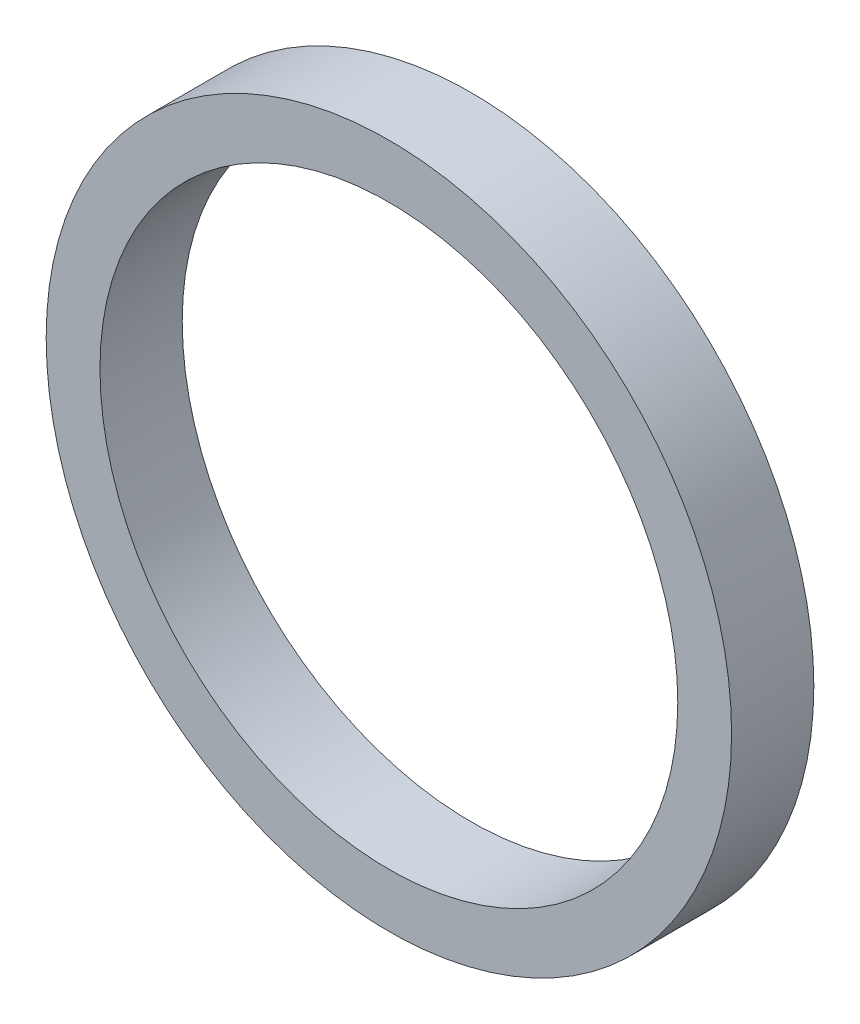
ISO-10303-21;
HEADER;
FILE_DESCRIPTION(('STEP AP214'),'2;1');
FILE_NAME('part.step','',(''),(''),'','','');
FILE_SCHEMA(('AUTOMOTIVE_DESIGN { 1 0 10303 214 1 1 1 1 }'));
ENDSEC;
DATA;
#1=APPLICATION_CONTEXT('core data for automotive mechanical design processes');
#2=APPLICATION_PROTOCOL_DEFINITION('international standard','automotive_design',2000,#1);
#3=PRODUCT_CONTEXT('',#1,'mechanical');
#4=PRODUCT('Part','Part','',(#3));
#5=PRODUCT_RELATED_PRODUCT_CATEGORY('part','',(#4));
#6=PRODUCT_DEFINITION_FORMATION('','',#4);
#7=PRODUCT_DEFINITION_CONTEXT('part definition',#1,'design');
#8=PRODUCT_DEFINITION('design','',#6,#7);
#9=PRODUCT_DEFINITION_SHAPE('','',#8);
#10=(LENGTH_UNIT() NAMED_UNIT(*) SI_UNIT(.MILLI.,.METRE.));
#11=(NAMED_UNIT(*) PLANE_ANGLE_UNIT() SI_UNIT($,.RADIAN.));
#12=(NAMED_UNIT(*) SI_UNIT($,.STERADIAN.) SOLID_ANGLE_UNIT());
#13=UNCERTAINTY_MEASURE_WITH_UNIT(LENGTH_MEASURE(1.E-05),#10,'distance_accuracy_value','');
#14=(GEOMETRIC_REPRESENTATION_CONTEXT(3) GLOBAL_UNCERTAINTY_ASSIGNED_CONTEXT((#13)) GLOBAL_UNIT_ASSIGNED_CONTEXT((#10,
#11,#12)) REPRESENTATION_CONTEXT('',''));
#15=CARTESIAN_POINT('',(0.,0.,0.));
#16=DIRECTION('',(0.,0.,1.));
#17=DIRECTION('',(1.,0.,0.));
#18=AXIS2_PLACEMENT_3D('',#15,#16,#17);
#19=CARTESIAN_POINT('',(0.,0.,6.));
#20=DIRECTION('',(0.,0.,-1.));
#21=DIRECTION('',(-1.,0.,0.));
#22=AXIS2_PLACEMENT_3D('',#19,#20,#21);
#23=CYLINDRICAL_SURFACE('',#22,25.);
#24=CARTESIAN_POINT('',(0.,0.,6.));
#25=DIRECTION('',(0.,0.,1.));
#26=DIRECTION('',(1.,0.,0.));
#27=AXIS2_PLACEMENT_3D('',#24,#25,#26);
#28=CIRCLE('',#27,25.);
#29=CARTESIAN_POINT('',(25.,0.,6.));
#30=VERTEX_POINT('',#29);
#31=EDGE_CURVE('E10',#30,#30,#28,.T.);
#32=ORIENTED_EDGE('',*,*,#31,.F.);
#33=EDGE_LOOP('',(#32));
#34=FACE_BOUND('',#33,.T.);
#35=CARTESIAN_POINT('',(0.,0.,0.));
#36=DIRECTION('',(0.,0.,1.));
#37=DIRECTION('',(1.,0.,0.));
#38=AXIS2_PLACEMENT_3D('',#35,#36,#37);
#39=CIRCLE('',#38,25.);
#40=CARTESIAN_POINT('',(25.,0.,0.));
#41=VERTEX_POINT('',#40);
#42=EDGE_CURVE('E34',#41,#41,#39,.T.);
#43=ORIENTED_EDGE('',*,*,#42,.T.);
#44=EDGE_LOOP('',(#43));
#45=FACE_BOUND('',#44,.T.);
#46=ADVANCED_FACE('F31',(#34,#45),#23,.T.);
#47=CARTESIAN_POINT('',(0.,0.,6.));
#48=DIRECTION('',(0.,0.,1.));
#49=DIRECTION('',(1.,0.,0.));
#50=AXIS2_PLACEMENT_3D('',#47,#48,#49);
#51=PLANE('',#50);
#52=CARTESIAN_POINT('',(0.,0.,6.));
#53=DIRECTION('',(0.,0.,-1.));
#54=DIRECTION('',(-1.,0.,0.));
#55=AXIS2_PLACEMENT_3D('',#52,#53,#54);
#56=CIRCLE('',#55,21.075);
#57=CARTESIAN_POINT('',(-21.075,0.,6.));
#58=VERTEX_POINT('',#57);
#59=EDGE_CURVE('E41',#58,#58,#56,.T.);
#60=ORIENTED_EDGE('',*,*,#59,.T.);
#61=EDGE_LOOP('',(#60));
#62=FACE_BOUND('',#61,.T.);
#63=ORIENTED_EDGE('',*,*,#31,.T.);
#64=EDGE_LOOP('',(#63));
#65=FACE_BOUND('',#64,.T.);
#66=ADVANCED_FACE('F49',(#62,#65),#51,.T.);
#67=CARTESIAN_POINT('',(0.,0.,0.));
#68=DIRECTION('',(0.,0.,1.));
#69=DIRECTION('',(1.,0.,0.));
#70=AXIS2_PLACEMENT_3D('',#67,#68,#69);
#71=PLANE('',#70);
#72=CARTESIAN_POINT('',(0.,0.,0.));
#73=DIRECTION('',(0.,0.,-1.));
#74=DIRECTION('',(-1.,0.,0.));
#75=AXIS2_PLACEMENT_3D('',#72,#73,#74);
#76=CIRCLE('',#75,21.075);
#77=CARTESIAN_POINT('',(-21.075,0.,0.));
#78=VERTEX_POINT('',#77);
#79=EDGE_CURVE('E43',#78,#78,#76,.T.);
#80=ORIENTED_EDGE('',*,*,#79,.F.);
#81=EDGE_LOOP('',(#80));
#82=FACE_BOUND('',#81,.T.);
#83=ORIENTED_EDGE('',*,*,#42,.F.);
#84=EDGE_LOOP('',(#83));
#85=FACE_BOUND('',#84,.T.);
#86=ADVANCED_FACE('F54',(#82,#85),#71,.F.);
#87=CARTESIAN_POINT('',(0.,0.,6.));
#88=DIRECTION('',(0.,0.,-1.));
#89=DIRECTION('',(-1.,0.,0.));
#90=AXIS2_PLACEMENT_3D('',#87,#88,#89);
#91=CYLINDRICAL_SURFACE('',#90,21.075);
#92=ORIENTED_EDGE('',*,*,#59,.F.);
#93=EDGE_LOOP('',(#92));
#94=FACE_BOUND('',#93,.T.);
#95=ORIENTED_EDGE('',*,*,#79,.T.);
#96=EDGE_LOOP('',(#95));
#97=FACE_BOUND('',#96,.T.);
#98=ADVANCED_FACE('F51',(#94,#97),#91,.F.);
#99=CLOSED_SHELL('',(#46,#66,#86,#98));
#100=MANIFOLD_SOLID_BREP('B2',#99);
#101=ADVANCED_BREP_SHAPE_REPRESENTATION('',(#18,#100),#14);
#102=SHAPE_DEFINITION_REPRESENTATION(#9,#101);
ENDSEC;
END-ISO-10303-21;
